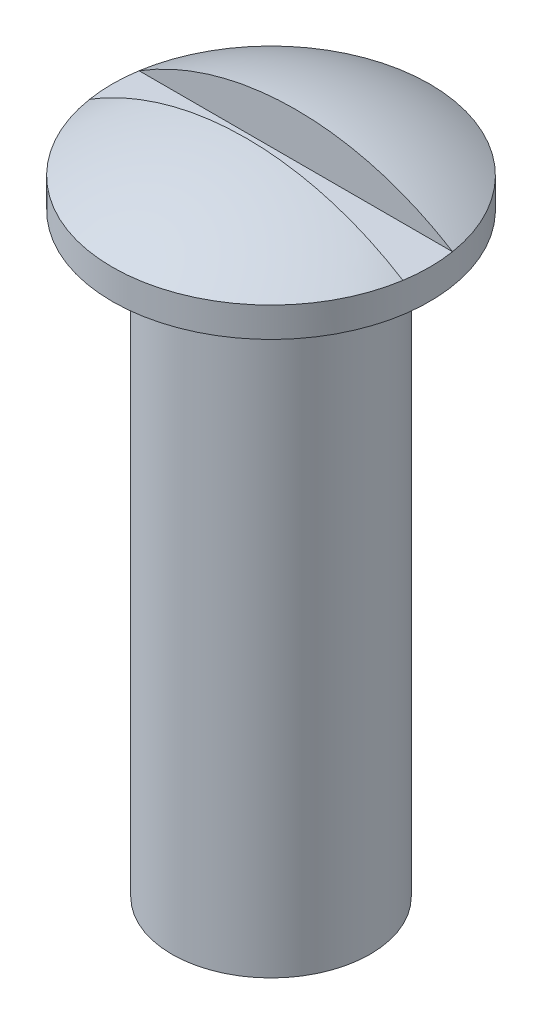
ISO-10303-21;
HEADER;
FILE_DESCRIPTION(('STEP AP214'),'2;1');
FILE_NAME('part.step','',(''),(''),'','','');
FILE_SCHEMA(('AUTOMOTIVE_DESIGN { 1 0 10303 214 1 1 1 1 }'));
ENDSEC;
DATA;
#1=APPLICATION_CONTEXT('core data for automotive mechanical design processes');
#2=APPLICATION_PROTOCOL_DEFINITION('international standard','automotive_design',2000,#1);
#3=PRODUCT_CONTEXT('',#1,'mechanical');
#4=PRODUCT('Part','Part','',(#3));
#5=PRODUCT_RELATED_PRODUCT_CATEGORY('part','',(#4));
#6=PRODUCT_DEFINITION_FORMATION('','',#4);
#7=PRODUCT_DEFINITION_CONTEXT('part definition',#1,'design');
#8=PRODUCT_DEFINITION('design','',#6,#7);
#9=PRODUCT_DEFINITION_SHAPE('','',#8);
#10=(LENGTH_UNIT() NAMED_UNIT(*) SI_UNIT(.MILLI.,.METRE.));
#11=(NAMED_UNIT(*) PLANE_ANGLE_UNIT() SI_UNIT($,.RADIAN.));
#12=(NAMED_UNIT(*) SI_UNIT($,.STERADIAN.) SOLID_ANGLE_UNIT());
#13=UNCERTAINTY_MEASURE_WITH_UNIT(LENGTH_MEASURE(1.E-05),#10,'distance_accuracy_value','');
#14=(GEOMETRIC_REPRESENTATION_CONTEXT(3) GLOBAL_UNCERTAINTY_ASSIGNED_CONTEXT((#13)) GLOBAL_UNIT_ASSIGNED_CONTEXT((#10,
#11,#12)) REPRESENTATION_CONTEXT('',''));
#15=CARTESIAN_POINT('',(0.,0.,0.));
#16=DIRECTION('',(0.,0.,1.));
#17=DIRECTION('',(1.,0.,0.));
#18=AXIS2_PLACEMENT_3D('',#15,#16,#17);
#19=CARTESIAN_POINT('',(-5.,6.3,0.25));
#20=DIRECTION('',(0.,-1.,0.));
#21=DIRECTION('',(0.,0.,-1.));
#22=AXIS2_PLACEMENT_3D('',#19,#20,#21);
#23=PLANE('',#22);
#24=DIRECTION('',(1.,0.,0.));
#25=VECTOR('',#24,1.);
#26=CARTESIAN_POINT('',(-5.,6.3,0.25));
#27=LINE('',#26,#25);
#28=CARTESIAN_POINT('',(-1.58034806292791,6.3,0.25));
#29=VERTEX_POINT('',#28);
#30=CARTESIAN_POINT('',(1.58034806292791,6.3,0.25));
#31=VERTEX_POINT('',#30);
#32=EDGE_CURVE('E58',#29,#31,#27,.T.);
#33=ORIENTED_EDGE('',*,*,#32,.T.);
#34=CARTESIAN_POINT('',(0.,6.3,0.));
#35=DIRECTION('',(0.,-1.,0.));
#36=DIRECTION('',(0.,0.,-1.));
#37=AXIS2_PLACEMENT_3D('',#34,#35,#36);
#38=CIRCLE('',#37,1.6);
#39=CARTESIAN_POINT('',(1.58034806292791,6.3,-0.250000000000001));
#40=VERTEX_POINT('',#39);
#41=EDGE_CURVE('E20',#40,#31,#38,.T.);
#42=ORIENTED_EDGE('',*,*,#41,.F.);
#43=DIRECTION('',(1.,0.,0.));
#44=VECTOR('',#43,1.);
#45=CARTESIAN_POINT('',(-5.,6.3,-0.25));
#46=LINE('',#45,#44);
#47=CARTESIAN_POINT('',(-1.58034806292791,6.3,-0.250000000000001));
#48=VERTEX_POINT('',#47);
#49=EDGE_CURVE('E60',#40,#48,#46,.F.);
#50=ORIENTED_EDGE('',*,*,#49,.T.);
#51=CARTESIAN_POINT('',(0.,6.3,0.));
#52=DIRECTION('',(0.,-1.,0.));
#53=DIRECTION('',(0.,0.,-1.));
#54=AXIS2_PLACEMENT_3D('',#51,#52,#53);
#55=CIRCLE('',#54,1.6);
#56=EDGE_CURVE('E35',#29,#48,#55,.T.);
#57=ORIENTED_EDGE('',*,*,#56,.F.);
#58=EDGE_LOOP('',(#33,#42,#50,#57));
#59=FACE_BOUND('',#58,.T.);
#60=ADVANCED_FACE('F17',(#59),#23,.F.);
#61=CARTESIAN_POINT('',(-5.,7.74008606997639,0.25));
#62=DIRECTION('',(0.,0.,1.));
#63=DIRECTION('',(0.,-1.,0.));
#64=AXIS2_PLACEMENT_3D('',#61,#62,#63);
#65=PLANE('',#64);
#66=ORIENTED_EDGE('',*,*,#32,.F.);
#67=CARTESIAN_POINT('',(1.58034806292791,6.3,0.25));
#68=CARTESIAN_POINT('',(1.50896794192082,6.34446108369893,0.25));
#69=CARTESIAN_POINT('',(1.43570681975758,6.38589447902669,0.25));
#70=CARTESIAN_POINT('',(1.28595983077063,6.46244484588158,0.25));
#71=CARTESIAN_POINT('',(1.20947411392197,6.49756211077112,0.25));
#72=CARTESIAN_POINT('',(1.05388269257591,6.56119299144367,0.25));
#73=CARTESIAN_POINT('',(0.97477955639264,6.58971287333934,0.25));
#74=CARTESIAN_POINT('',(0.814477319074666,6.63999062540024,0.25));
#75=CARTESIAN_POINT('',(0.733278248580179,6.66174859435652,0.25));
#76=CARTESIAN_POINT('',(0.487317207479069,6.71663439505544,0.25));
#77=CARTESIAN_POINT('',(0.320112701366049,6.7394062252964,0.25));
#78=CARTESIAN_POINT('',(-0.0157002429055117,6.75653890424331,0.25));
#79=CARTESIAN_POINT('',(-0.184308982216372,6.7508934933135,0.25));
#80=CARTESIAN_POINT('',(-0.518284533434301,6.71138231786855,0.25));
#81=CARTESIAN_POINT('',(-0.683649282697956,6.67749915837349,0.249999999999999));
#82=CARTESIAN_POINT('',(-1.00619884910442,6.58243498186304,0.250000000000001));
#83=CARTESIAN_POINT('',(-1.16339519713547,6.5212936808353,0.250000000000004));
#84=CARTESIAN_POINT('',(-1.35978607636399,6.42519229731197,0.249999999999999));
#85=CARTESIAN_POINT('',(-1.40482812591175,6.40170578429477,0.249999999999997));
#86=CARTESIAN_POINT('',(-1.49358219629261,6.35251114553921,0.250000000000003));
#87=CARTESIAN_POINT('',(-1.53729634829711,6.32680686499364,0.25000000000001));
#88=CARTESIAN_POINT('',(-1.58034806292791,6.3,0.250000000000028));
#89=B_SPLINE_CURVE_WITH_KNOTS('',3,(#67,#68,#69,#70,#71,#72,#73,#74,#75,#76,#77,#78,#79,#80,#81,
#82,#83,#84,#85,#86,#87,#88),.UNSPECIFIED.,.F.,.F.,(4,2,2,2,2,2,2,2,2,2,4),(0.,
0.252201922151327,0.504392127369465,0.756341812878911,1.00828781724905,1.51192803419273,
2.0156791958351,2.51974090717012,3.02307057255868,3.17541854643481,3.32750749068285),.UNSPECIFIED.);
#90=EDGE_CURVE('E49',#31,#29,#89,.T.);
#91=ORIENTED_EDGE('',*,*,#90,.F.);
#92=EDGE_LOOP('',(#66,#91));
#93=FACE_BOUND('',#92,.T.);
#94=ADVANCED_FACE('F62',(#93),#65,.F.);
#95=CARTESIAN_POINT('',(-5.,7.74008606997639,-0.25));
#96=DIRECTION('',(0.,0.,-1.));
#97=DIRECTION('',(0.,1.,0.));
#98=AXIS2_PLACEMENT_3D('',#95,#96,#97);
#99=PLANE('',#98);
#100=ORIENTED_EDGE('',*,*,#49,.F.);
#101=CARTESIAN_POINT('',(-1.58034806292791,6.3,-0.250000000000002));
#102=CARTESIAN_POINT('',(-1.50896794192081,6.34446108369893,-0.250000000000001));
#103=CARTESIAN_POINT('',(-1.43570681975758,6.38589447902669,-0.25));
#104=CARTESIAN_POINT('',(-1.28595983077063,6.46244484588158,-0.25));
#105=CARTESIAN_POINT('',(-1.20947411392197,6.49756211077112,-0.25));
#106=CARTESIAN_POINT('',(-1.05388269257591,6.56119299144367,-0.25));
#107=CARTESIAN_POINT('',(-0.97477955639264,6.58971287333934,-0.25));
#108=CARTESIAN_POINT('',(-0.814477319074666,6.63999062540024,-0.25));
#109=CARTESIAN_POINT('',(-0.733278248580179,6.66174859435652,-0.25));
#110=CARTESIAN_POINT('',(-0.487317207479069,6.71663439505544,-0.25));
#111=CARTESIAN_POINT('',(-0.320112701366049,6.7394062252964,-0.25));
#112=CARTESIAN_POINT('',(0.0157002429055119,6.75653890424331,-0.25));
#113=CARTESIAN_POINT('',(0.184308982216372,6.7508934933135,-0.250000000000001));
#114=CARTESIAN_POINT('',(0.518284533434302,6.71138231786855,-0.250000000000001));
#115=CARTESIAN_POINT('',(0.683649282697956,6.67749915837349,-0.25));
#116=CARTESIAN_POINT('',(1.00619884910442,6.58243498186304,-0.25));
#117=CARTESIAN_POINT('',(1.16339519713547,6.5212936808353,-0.250000000000002));
#118=CARTESIAN_POINT('',(1.35978607636399,6.42519229731197,-0.249999999999998));
#119=CARTESIAN_POINT('',(1.40482812591175,6.40170578429478,-0.249999999999997));
#120=CARTESIAN_POINT('',(1.49358219629261,6.35251114553921,-0.250000000000003));
#121=CARTESIAN_POINT('',(1.53729634829711,6.32680686499364,-0.250000000000011));
#122=CARTESIAN_POINT('',(1.58034806292791,6.3,-0.250000000000029));
#123=B_SPLINE_CURVE_WITH_KNOTS('',3,(#101,#102,#103,#104,#105,#106,#107,#108,#109,#110,#111,
#112,#113,#114,#115,#116,#117,#118,#119,#120,#121,#122),.UNSPECIFIED.,.F.,.F.,(4,2,2,2,2,2,2,2,
2,2,4),(0.,0.252201922151326,0.504392127369464,0.756341812878911,1.00828781724905,
1.51192803419273,2.0156791958351,2.51974090717012,3.02307057255868,3.17541854643481,
3.32750749068285),.UNSPECIFIED.);
#124=EDGE_CURVE('E50',#48,#40,#123,.T.);
#125=ORIENTED_EDGE('',*,*,#124,.F.);
#126=EDGE_LOOP('',(#100,#125));
#127=FACE_BOUND('',#126,.T.);
#128=ADVANCED_FACE('F81',(#127),#99,.F.);
#129=CARTESIAN_POINT('',(0.,3.7622844919101,0.));
#130=DIRECTION('',(1.,0.,0.));
#131=DIRECTION('',(0.,1.,0.));
#132=AXIS2_PLACEMENT_3D('',#129,#130,#131);
#133=SPHERICAL_SURFACE('',#132,3.);
#134=CARTESIAN_POINT('',(0.,6.3,0.));
#135=DIRECTION('',(0.,-1.,0.));
#136=DIRECTION('',(0.,0.,-1.));
#137=AXIS2_PLACEMENT_3D('',#134,#135,#136);
#138=CIRCLE('',#137,1.6);
#139=EDGE_CURVE('E46',#31,#29,#138,.T.);
#140=ORIENTED_EDGE('',*,*,#139,.F.);
#141=ORIENTED_EDGE('',*,*,#90,.T.);
#142=EDGE_LOOP('',(#140,#141));
#143=FACE_BOUND('',#142,.T.);
#144=ADVANCED_FACE('F47',(#143),#133,.T.);
#145=CARTESIAN_POINT('',(0.,3.7622844919101,0.));
#146=DIRECTION('',(1.,0.,0.));
#147=DIRECTION('',(0.,1.,0.));
#148=AXIS2_PLACEMENT_3D('',#145,#146,#147);
#149=SPHERICAL_SURFACE('',#148,3.);
#150=ORIENTED_EDGE('',*,*,#124,.T.);
#151=CARTESIAN_POINT('',(0.,6.3,0.));
#152=DIRECTION('',(0.,-1.,0.));
#153=DIRECTION('',(0.,0.,-1.));
#154=AXIS2_PLACEMENT_3D('',#151,#152,#153);
#155=CIRCLE('',#154,1.6);
#156=EDGE_CURVE('E41',#48,#40,#155,.T.);
#157=ORIENTED_EDGE('',*,*,#156,.F.);
#158=EDGE_LOOP('',(#150,#157));
#159=FACE_BOUND('',#158,.T.);
#160=ADVANCED_FACE('F80',(#159),#149,.T.);
#161=CARTESIAN_POINT('',(0.,2.79579606906158,0.));
#162=DIRECTION('',(0.,-1.,0.));
#163=DIRECTION('',(0.,0.,-1.));
#164=AXIS2_PLACEMENT_3D('',#161,#162,#163);
#165=CYLINDRICAL_SURFACE('',#164,1.6);
#166=ORIENTED_EDGE('',*,*,#41,.T.);
#167=ORIENTED_EDGE('',*,*,#139,.T.);
#168=ORIENTED_EDGE('',*,*,#56,.T.);
#169=ORIENTED_EDGE('',*,*,#156,.T.);
#170=EDGE_LOOP('',(#166,#167,#168,#169));
#171=FACE_BOUND('',#170,.T.);
#172=CARTESIAN_POINT('',(0.,6.,0.));
#173=DIRECTION('',(0.,-1.,0.));
#174=DIRECTION('',(0.,0.,-1.));
#175=AXIS2_PLACEMENT_3D('',#172,#173,#174);
#176=CIRCLE('',#175,1.6);
#177=CARTESIAN_POINT('',(0.,6.,-1.6));
#178=VERTEX_POINT('',#177);
#179=EDGE_CURVE('E91',#178,#178,#176,.T.);
#180=ORIENTED_EDGE('',*,*,#179,.F.);
#181=EDGE_LOOP('',(#180));
#182=FACE_BOUND('',#181,.T.);
#183=ADVANCED_FACE('F53',(#171,#182),#165,.T.);
#184=CARTESIAN_POINT('',(1.,6.,0.));
#185=DIRECTION('',(0.,-1.,0.));
#186=DIRECTION('',(0.,0.,-1.));
#187=AXIS2_PLACEMENT_3D('',#184,#185,#186);
#188=PLANE('',#187);
#189=CARTESIAN_POINT('',(0.,6.,0.));
#190=DIRECTION('',(0.,-1.,0.));
#191=DIRECTION('',(0.,0.,-1.));
#192=AXIS2_PLACEMENT_3D('',#189,#190,#191);
#193=CIRCLE('',#192,1.);
#194=CARTESIAN_POINT('',(0.,6.,-1.));
#195=VERTEX_POINT('',#194);
#196=EDGE_CURVE('E26',#195,#195,#193,.T.);
#197=ORIENTED_EDGE('',*,*,#196,.F.);
#198=EDGE_LOOP('',(#197));
#199=FACE_BOUND('',#198,.T.);
#200=ORIENTED_EDGE('',*,*,#179,.T.);
#201=EDGE_LOOP('',(#200));
#202=FACE_BOUND('',#201,.T.);
#203=ADVANCED_FACE('F96',(#199,#202),#188,.T.);
#204=CARTESIAN_POINT('',(0.,0.,0.));
#205=DIRECTION('',(0.,-1.,0.));
#206=DIRECTION('',(0.,0.,-1.));
#207=AXIS2_PLACEMENT_3D('',#204,#205,#206);
#208=PLANE('',#207);
#209=CARTESIAN_POINT('',(0.,0.,0.));
#210=DIRECTION('',(0.,-1.,0.));
#211=DIRECTION('',(0.,0.,-1.));
#212=AXIS2_PLACEMENT_3D('',#209,#210,#211);
#213=CIRCLE('',#212,1.);
#214=CARTESIAN_POINT('',(0.,0.,-1.));
#215=VERTEX_POINT('',#214);
#216=EDGE_CURVE('E11',#215,#215,#213,.F.);
#217=ORIENTED_EDGE('',*,*,#216,.F.);
#218=EDGE_LOOP('',(#217));
#219=FACE_BOUND('',#218,.T.);
#220=ADVANCED_FACE('F103',(#219),#208,.T.);
#221=CARTESIAN_POINT('',(0.,2.79579606906158,0.));
#222=DIRECTION('',(0.,-1.,0.));
#223=DIRECTION('',(0.,0.,-1.));
#224=AXIS2_PLACEMENT_3D('',#221,#222,#223);
#225=CYLINDRICAL_SURFACE('',#224,1.);
#226=ORIENTED_EDGE('',*,*,#216,.T.);
#227=EDGE_LOOP('',(#226));
#228=FACE_BOUND('',#227,.T.);
#229=ORIENTED_EDGE('',*,*,#196,.T.);
#230=EDGE_LOOP('',(#229));
#231=FACE_BOUND('',#230,.T.);
#232=ADVANCED_FACE('F107',(#228,#231),#225,.T.);
#233=CLOSED_SHELL('',(#60,#94,#128,#144,#160,#183,#203,#220,#232));
#234=MANIFOLD_SOLID_BREP('B1',#233);
#235=ADVANCED_BREP_SHAPE_REPRESENTATION('',(#18,#234),#14);
#236=SHAPE_DEFINITION_REPRESENTATION(#9,#235);
ENDSEC;
END-ISO-10303-21;
